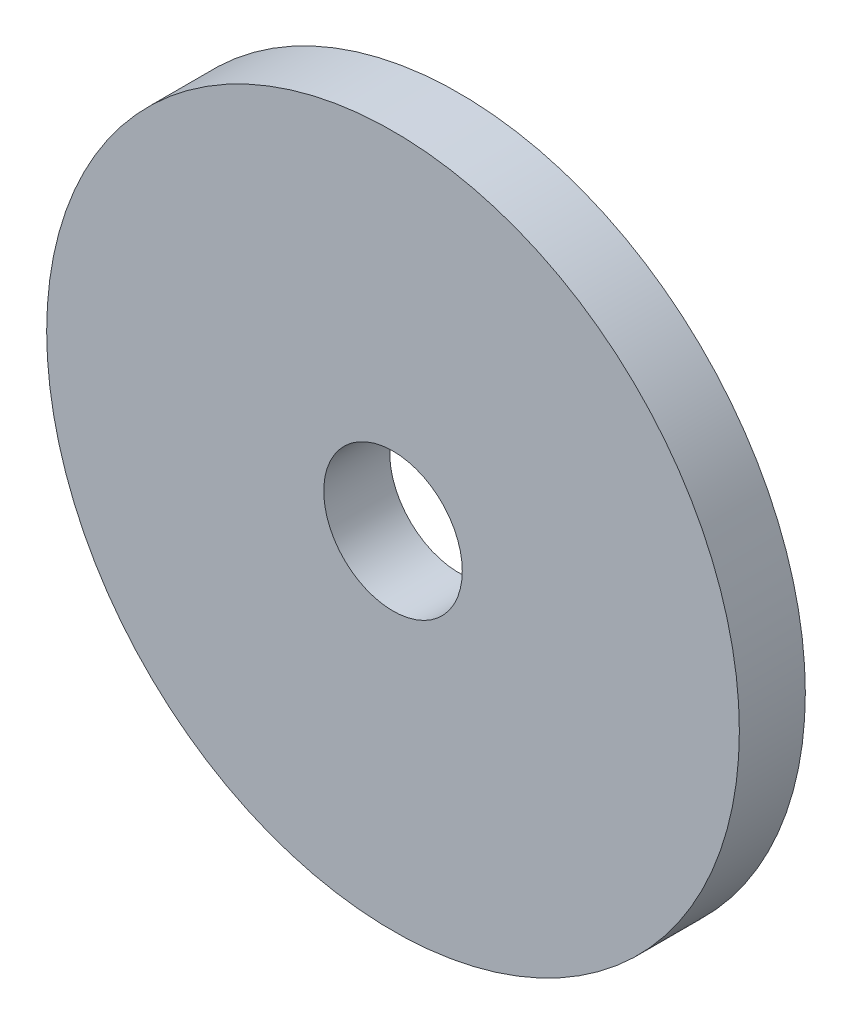
ISO-10303-21;
HEADER;
FILE_DESCRIPTION(('STEP AP214'),'2;1');
FILE_NAME('part.step','',(''),(''),'','','');
FILE_SCHEMA(('AUTOMOTIVE_DESIGN { 1 0 10303 214 1 1 1 1 }'));
ENDSEC;
DATA;
#1=APPLICATION_CONTEXT('core data for automotive mechanical design processes');
#2=APPLICATION_PROTOCOL_DEFINITION('international standard','automotive_design',2000,#1);
#3=PRODUCT_CONTEXT('',#1,'mechanical');
#4=PRODUCT('Part','Part','',(#3));
#5=PRODUCT_RELATED_PRODUCT_CATEGORY('part','',(#4));
#6=PRODUCT_DEFINITION_FORMATION('','',#4);
#7=PRODUCT_DEFINITION_CONTEXT('part definition',#1,'design');
#8=PRODUCT_DEFINITION('design','',#6,#7);
#9=PRODUCT_DEFINITION_SHAPE('','',#8);
#10=(LENGTH_UNIT() NAMED_UNIT(*) SI_UNIT(.MILLI.,.METRE.));
#11=(NAMED_UNIT(*) PLANE_ANGLE_UNIT() SI_UNIT($,.RADIAN.));
#12=(NAMED_UNIT(*) SI_UNIT($,.STERADIAN.) SOLID_ANGLE_UNIT());
#13=UNCERTAINTY_MEASURE_WITH_UNIT(LENGTH_MEASURE(1.E-05),#10,'distance_accuracy_value','');
#14=(GEOMETRIC_REPRESENTATION_CONTEXT(3) GLOBAL_UNCERTAINTY_ASSIGNED_CONTEXT((#13)) GLOBAL_UNIT_ASSIGNED_CONTEXT((#10,
#11,#12)) REPRESENTATION_CONTEXT('',''));
#15=CARTESIAN_POINT('',(0.,0.,0.));
#16=DIRECTION('',(0.,0.,1.));
#17=DIRECTION('',(1.,0.,0.));
#18=AXIS2_PLACEMENT_3D('',#15,#16,#17);
#19=CARTESIAN_POINT('',(0.,0.,2.));
#20=DIRECTION('',(0.,0.,1.));
#21=DIRECTION('',(1.,0.,0.));
#22=AXIS2_PLACEMENT_3D('',#19,#20,#21);
#23=PLANE('',#22);
#24=CARTESIAN_POINT('',(0.,0.,2.));
#25=DIRECTION('',(0.,0.,1.));
#26=DIRECTION('',(1.,0.,0.));
#27=AXIS2_PLACEMENT_3D('',#24,#25,#26);
#28=CIRCLE('',#27,10.5);
#29=CARTESIAN_POINT('',(10.5,0.,2.));
#30=VERTEX_POINT('',#29);
#31=EDGE_CURVE('E10',#30,#30,#28,.T.);
#32=ORIENTED_EDGE('',*,*,#31,.T.);
#33=EDGE_LOOP('',(#32));
#34=FACE_BOUND('',#33,.T.);
#35=CARTESIAN_POINT('',(0.,0.,2.));
#36=DIRECTION('',(0.,0.,1.));
#37=DIRECTION('',(1.,0.,0.));
#38=AXIS2_PLACEMENT_3D('',#35,#36,#37);
#39=CIRCLE('',#38,2.1);
#40=CARTESIAN_POINT('',(2.1,0.,2.));
#41=VERTEX_POINT('',#40);
#42=EDGE_CURVE('E41',#41,#41,#39,.T.);
#43=ORIENTED_EDGE('',*,*,#42,.F.);
#44=EDGE_LOOP('',(#43));
#45=FACE_BOUND('',#44,.T.);
#46=ADVANCED_FACE('F30',(#34,#45),#23,.T.);
#47=CARTESIAN_POINT('',(0.,0.,0.));
#48=DIRECTION('',(0.,0.,1.));
#49=DIRECTION('',(1.,0.,0.));
#50=AXIS2_PLACEMENT_3D('',#47,#48,#49);
#51=PLANE('',#50);
#52=CARTESIAN_POINT('',(0.,0.,0.));
#53=DIRECTION('',(0.,0.,1.));
#54=DIRECTION('',(1.,0.,0.));
#55=AXIS2_PLACEMENT_3D('',#52,#53,#54);
#56=CIRCLE('',#55,10.5);
#57=CARTESIAN_POINT('',(10.5,0.,0.));
#58=VERTEX_POINT('',#57);
#59=EDGE_CURVE('E34',#58,#58,#56,.T.);
#60=ORIENTED_EDGE('',*,*,#59,.F.);
#61=EDGE_LOOP('',(#60));
#62=FACE_BOUND('',#61,.T.);
#63=CARTESIAN_POINT('',(0.,0.,0.));
#64=DIRECTION('',(0.,0.,1.));
#65=DIRECTION('',(1.,0.,0.));
#66=AXIS2_PLACEMENT_3D('',#63,#64,#65);
#67=CIRCLE('',#66,2.1);
#68=CARTESIAN_POINT('',(2.1,0.,0.));
#69=VERTEX_POINT('',#68);
#70=EDGE_CURVE('E43',#69,#69,#67,.T.);
#71=ORIENTED_EDGE('',*,*,#70,.T.);
#72=EDGE_LOOP('',(#71));
#73=FACE_BOUND('',#72,.T.);
#74=ADVANCED_FACE('F53',(#62,#73),#51,.F.);
#75=CARTESIAN_POINT('',(0.,0.,2.));
#76=DIRECTION('',(0.,0.,-1.));
#77=DIRECTION('',(-1.,0.,0.));
#78=AXIS2_PLACEMENT_3D('',#75,#76,#77);
#79=CYLINDRICAL_SURFACE('',#78,10.5);
#80=ORIENTED_EDGE('',*,*,#31,.F.);
#81=EDGE_LOOP('',(#80));
#82=FACE_BOUND('',#81,.T.);
#83=ORIENTED_EDGE('',*,*,#59,.T.);
#84=EDGE_LOOP('',(#83));
#85=FACE_BOUND('',#84,.T.);
#86=ADVANCED_FACE('F32',(#82,#85),#79,.T.);
#87=CARTESIAN_POINT('',(0.,0.,2.));
#88=DIRECTION('',(0.,0.,-1.));
#89=DIRECTION('',(-1.,0.,0.));
#90=AXIS2_PLACEMENT_3D('',#87,#88,#89);
#91=CYLINDRICAL_SURFACE('',#90,2.1);
#92=ORIENTED_EDGE('',*,*,#42,.T.);
#93=EDGE_LOOP('',(#92));
#94=FACE_BOUND('',#93,.T.);
#95=ORIENTED_EDGE('',*,*,#70,.F.);
#96=EDGE_LOOP('',(#95));
#97=FACE_BOUND('',#96,.T.);
#98=ADVANCED_FACE('F49',(#94,#97),#91,.F.);
#99=CLOSED_SHELL('',(#46,#74,#86,#98));
#100=MANIFOLD_SOLID_BREP('B2',#99);
#101=ADVANCED_BREP_SHAPE_REPRESENTATION('',(#18,#100),#14);
#102=SHAPE_DEFINITION_REPRESENTATION(#9,#101);
ENDSEC;
END-ISO-10303-21;
